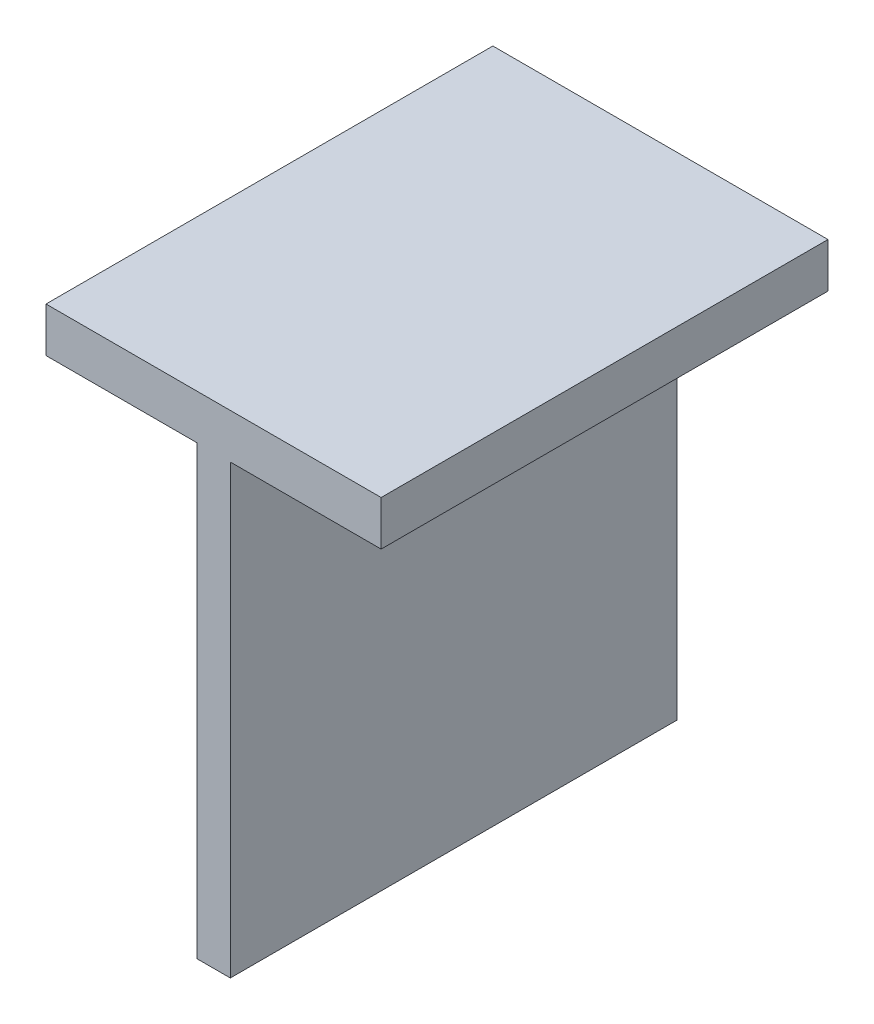
ISO-10303-21;
HEADER;
FILE_DESCRIPTION(('STEP AP214'),'2;1');
FILE_NAME('part.step','',(''),(''),'','','');
FILE_SCHEMA(('AUTOMOTIVE_DESIGN { 1 0 10303 214 1 1 1 1 }'));
ENDSEC;
DATA;
#1=APPLICATION_CONTEXT('core data for automotive mechanical design processes');
#2=APPLICATION_PROTOCOL_DEFINITION('international standard','automotive_design',2000,#1);
#3=PRODUCT_CONTEXT('',#1,'mechanical');
#4=PRODUCT('Part','Part','',(#3));
#5=PRODUCT_RELATED_PRODUCT_CATEGORY('part','',(#4));
#6=PRODUCT_DEFINITION_FORMATION('','',#4);
#7=PRODUCT_DEFINITION_CONTEXT('part definition',#1,'design');
#8=PRODUCT_DEFINITION('design','',#6,#7);
#9=PRODUCT_DEFINITION_SHAPE('','',#8);
#10=(LENGTH_UNIT() NAMED_UNIT(*) SI_UNIT(.MILLI.,.METRE.));
#11=(NAMED_UNIT(*) PLANE_ANGLE_UNIT() SI_UNIT($,.RADIAN.));
#12=(NAMED_UNIT(*) SI_UNIT($,.STERADIAN.) SOLID_ANGLE_UNIT());
#13=UNCERTAINTY_MEASURE_WITH_UNIT(LENGTH_MEASURE(1.E-05),#10,'distance_accuracy_value','');
#14=(GEOMETRIC_REPRESENTATION_CONTEXT(3) GLOBAL_UNCERTAINTY_ASSIGNED_CONTEXT((#13)) GLOBAL_UNIT_ASSIGNED_CONTEXT((#10,
#11,#12)) REPRESENTATION_CONTEXT('',''));
#15=CARTESIAN_POINT('',(0.,0.,0.));
#16=DIRECTION('',(0.,0.,1.));
#17=DIRECTION('',(1.,0.,0.));
#18=AXIS2_PLACEMENT_3D('',#15,#16,#17);
#19=CARTESIAN_POINT('',(-75.,0.,2000.));
#20=DIRECTION('',(0.,1.,0.));
#21=DIRECTION('',(0.,0.,1.));
#22=AXIS2_PLACEMENT_3D('',#19,#20,#21);
#23=PLANE('',#22);
#24=DIRECTION('',(1.,0.,0.));
#25=VECTOR('',#24,1.);
#26=CARTESIAN_POINT('',(-75.,0.,0.));
#27=LINE('',#26,#25);
#28=CARTESIAN_POINT('',(-75.,0.,0.));
#29=VERTEX_POINT('',#28);
#30=CARTESIAN_POINT('',(75.,0.,0.));
#31=VERTEX_POINT('',#30);
#32=EDGE_CURVE('E133',#29,#31,#27,.T.);
#33=ORIENTED_EDGE('',*,*,#32,.T.);
#34=DIRECTION('',(0.,0.,-1.));
#35=VECTOR('',#34,1.);
#36=CARTESIAN_POINT('',(75.,0.,2000.));
#37=LINE('',#36,#35);
#38=CARTESIAN_POINT('',(75.,0.,2000.));
#39=VERTEX_POINT('',#38);
#40=EDGE_CURVE('E11',#39,#31,#37,.T.);
#41=ORIENTED_EDGE('',*,*,#40,.F.);
#42=DIRECTION('',(1.,0.,0.));
#43=VECTOR('',#42,1.);
#44=CARTESIAN_POINT('',(-75.,0.,2000.));
#45=LINE('',#44,#43);
#46=CARTESIAN_POINT('',(-75.,0.,2000.));
#47=VERTEX_POINT('',#46);
#48=EDGE_CURVE('E147',#47,#39,#45,.T.);
#49=ORIENTED_EDGE('',*,*,#48,.F.);
#50=DIRECTION('',(0.,0.,-1.));
#51=VECTOR('',#50,1.);
#52=CARTESIAN_POINT('',(-75.,0.,2000.));
#53=LINE('',#52,#51);
#54=EDGE_CURVE('E129',#47,#29,#53,.T.);
#55=ORIENTED_EDGE('',*,*,#54,.T.);
#56=EDGE_LOOP('',(#33,#41,#49,#55));
#57=FACE_BOUND('',#56,.T.);
#58=ADVANCED_FACE('F37',(#57),#23,.F.);
#59=CARTESIAN_POINT('',(75.,0.,2000.));
#60=DIRECTION('',(-1.,0.,0.));
#61=DIRECTION('',(0.,-1.,0.));
#62=AXIS2_PLACEMENT_3D('',#59,#60,#61);
#63=PLANE('',#62);
#64=DIRECTION('',(0.,1.,0.));
#65=VECTOR('',#64,1.);
#66=CARTESIAN_POINT('',(75.,0.,0.));
#67=LINE('',#66,#65);
#68=CARTESIAN_POINT('',(75.0000000000002,2000.,0.));
#69=VERTEX_POINT('',#68);
#70=EDGE_CURVE('E136',#31,#69,#67,.T.);
#71=ORIENTED_EDGE('',*,*,#70,.T.);
#72=DIRECTION('',(0.,0.,-1.));
#73=VECTOR('',#72,1.);
#74=CARTESIAN_POINT('',(75.0000000000002,2000.,2000.));
#75=LINE('',#74,#73);
#76=CARTESIAN_POINT('',(75.0000000000002,2000.,2000.));
#77=VERTEX_POINT('',#76);
#78=EDGE_CURVE('E45',#77,#69,#75,.T.);
#79=ORIENTED_EDGE('',*,*,#78,.F.);
#80=DIRECTION('',(0.,1.,0.));
#81=VECTOR('',#80,1.);
#82=CARTESIAN_POINT('',(75.,0.,2000.));
#83=LINE('',#82,#81);
#84=EDGE_CURVE('E96',#39,#77,#83,.T.);
#85=ORIENTED_EDGE('',*,*,#84,.F.);
#86=ORIENTED_EDGE('',*,*,#40,.T.);
#87=EDGE_LOOP('',(#71,#79,#85,#86));
#88=FACE_BOUND('',#87,.T.);
#89=ADVANCED_FACE('F182',(#88),#63,.F.);
#90=CARTESIAN_POINT('',(75.0000000000002,2000.,2000.));
#91=DIRECTION('',(0.,1.,0.));
#92=DIRECTION('',(0.,0.,1.));
#93=AXIS2_PLACEMENT_3D('',#90,#91,#92);
#94=PLANE('',#93);
#95=DIRECTION('',(1.,0.,0.));
#96=VECTOR('',#95,1.);
#97=CARTESIAN_POINT('',(75.0000000000002,2000.,0.));
#98=LINE('',#97,#96);
#99=CARTESIAN_POINT('',(750.,2000.,0.));
#100=VERTEX_POINT('',#99);
#101=EDGE_CURVE('E138',#69,#100,#98,.T.);
#102=ORIENTED_EDGE('',*,*,#101,.T.);
#103=DIRECTION('',(0.,0.,-1.));
#104=VECTOR('',#103,1.);
#105=CARTESIAN_POINT('',(750.,2000.,2000.));
#106=LINE('',#105,#104);
#107=CARTESIAN_POINT('',(750.,2000.,2000.));
#108=VERTEX_POINT('',#107);
#109=EDGE_CURVE('E154',#108,#100,#106,.T.);
#110=ORIENTED_EDGE('',*,*,#109,.F.);
#111=DIRECTION('',(1.,0.,0.));
#112=VECTOR('',#111,1.);
#113=CARTESIAN_POINT('',(75.0000000000002,2000.,2000.));
#114=LINE('',#113,#112);
#115=EDGE_CURVE('E162',#77,#108,#114,.T.);
#116=ORIENTED_EDGE('',*,*,#115,.F.);
#117=ORIENTED_EDGE('',*,*,#78,.T.);
#118=EDGE_LOOP('',(#102,#110,#116,#117));
#119=FACE_BOUND('',#118,.T.);
#120=ADVANCED_FACE('F160',(#119),#94,.F.);
#121=CARTESIAN_POINT('',(750.,2000.,2000.));
#122=DIRECTION('',(-1.,0.,0.));
#123=DIRECTION('',(0.,0.,1.));
#124=AXIS2_PLACEMENT_3D('',#121,#122,#123);
#125=PLANE('',#124);
#126=DIRECTION('',(0.,1.,0.));
#127=VECTOR('',#126,1.);
#128=CARTESIAN_POINT('',(750.,2000.,0.));
#129=LINE('',#128,#127);
#130=CARTESIAN_POINT('',(750.,2200.,0.));
#131=VERTEX_POINT('',#130);
#132=EDGE_CURVE('E140',#100,#131,#129,.T.);
#133=ORIENTED_EDGE('',*,*,#132,.T.);
#134=DIRECTION('',(0.,0.,-1.));
#135=VECTOR('',#134,1.);
#136=CARTESIAN_POINT('',(750.,2200.,2000.));
#137=LINE('',#136,#135);
#138=CARTESIAN_POINT('',(750.,2200.,2000.));
#139=VERTEX_POINT('',#138);
#140=EDGE_CURVE('E151',#139,#131,#137,.T.);
#141=ORIENTED_EDGE('',*,*,#140,.F.);
#142=DIRECTION('',(0.,1.,0.));
#143=VECTOR('',#142,1.);
#144=CARTESIAN_POINT('',(750.,2000.,2000.));
#145=LINE('',#144,#143);
#146=EDGE_CURVE('E174',#108,#139,#145,.T.);
#147=ORIENTED_EDGE('',*,*,#146,.F.);
#148=ORIENTED_EDGE('',*,*,#109,.T.);
#149=EDGE_LOOP('',(#133,#141,#147,#148));
#150=FACE_BOUND('',#149,.T.);
#151=ADVANCED_FACE('F170',(#150),#125,.F.);
#152=CARTESIAN_POINT('',(750.,2200.,2000.));
#153=DIRECTION('',(0.,-1.,0.));
#154=DIRECTION('',(0.,0.,-1.));
#155=AXIS2_PLACEMENT_3D('',#152,#153,#154);
#156=PLANE('',#155);
#157=DIRECTION('',(-1.,0.,0.));
#158=VECTOR('',#157,1.);
#159=CARTESIAN_POINT('',(750.,2200.,0.));
#160=LINE('',#159,#158);
#161=CARTESIAN_POINT('',(-750.,2200.,0.));
#162=VERTEX_POINT('',#161);
#163=EDGE_CURVE('E142',#131,#162,#160,.T.);
#164=ORIENTED_EDGE('',*,*,#163,.T.);
#165=DIRECTION('',(0.,0.,-1.));
#166=VECTOR('',#165,1.);
#167=CARTESIAN_POINT('',(-750.,2200.,2000.));
#168=LINE('',#167,#166);
#169=CARTESIAN_POINT('',(-750.,2200.,2000.));
#170=VERTEX_POINT('',#169);
#171=EDGE_CURVE('E124',#170,#162,#168,.T.);
#172=ORIENTED_EDGE('',*,*,#171,.F.);
#173=DIRECTION('',(-1.,0.,0.));
#174=VECTOR('',#173,1.);
#175=CARTESIAN_POINT('',(750.,2200.,2000.));
#176=LINE('',#175,#174);
#177=EDGE_CURVE('E115',#139,#170,#176,.T.);
#178=ORIENTED_EDGE('',*,*,#177,.F.);
#179=ORIENTED_EDGE('',*,*,#140,.T.);
#180=EDGE_LOOP('',(#164,#172,#178,#179));
#181=FACE_BOUND('',#180,.T.);
#182=ADVANCED_FACE('F173',(#181),#156,.F.);
#183=CARTESIAN_POINT('',(-750.,2200.,2000.));
#184=DIRECTION('',(1.,0.,0.));
#185=DIRECTION('',(0.,0.,-1.));
#186=AXIS2_PLACEMENT_3D('',#183,#184,#185);
#187=PLANE('',#186);
#188=DIRECTION('',(0.,-1.,0.));
#189=VECTOR('',#188,1.);
#190=CARTESIAN_POINT('',(-750.,2200.,0.));
#191=LINE('',#190,#189);
#192=CARTESIAN_POINT('',(-750.,2000.,0.));
#193=VERTEX_POINT('',#192);
#194=EDGE_CURVE('E123',#162,#193,#191,.T.);
#195=ORIENTED_EDGE('',*,*,#194,.T.);
#196=DIRECTION('',(0.,0.,-1.));
#197=VECTOR('',#196,1.);
#198=CARTESIAN_POINT('',(-750.,2000.,2000.));
#199=LINE('',#198,#197);
#200=CARTESIAN_POINT('',(-750.,2000.,2000.));
#201=VERTEX_POINT('',#200);
#202=EDGE_CURVE('E120',#201,#193,#199,.T.);
#203=ORIENTED_EDGE('',*,*,#202,.F.);
#204=DIRECTION('',(0.,-1.,0.));
#205=VECTOR('',#204,1.);
#206=CARTESIAN_POINT('',(-750.,2200.,2000.));
#207=LINE('',#206,#205);
#208=EDGE_CURVE('E109',#170,#201,#207,.T.);
#209=ORIENTED_EDGE('',*,*,#208,.F.);
#210=ORIENTED_EDGE('',*,*,#171,.T.);
#211=EDGE_LOOP('',(#195,#203,#209,#210));
#212=FACE_BOUND('',#211,.T.);
#213=ADVANCED_FACE('F121',(#212),#187,.F.);
#214=CARTESIAN_POINT('',(-750.,2000.,2000.));
#215=DIRECTION('',(0.,1.,0.));
#216=DIRECTION('',(0.,0.,1.));
#217=AXIS2_PLACEMENT_3D('',#214,#215,#216);
#218=PLANE('',#217);
#219=DIRECTION('',(1.,0.,0.));
#220=VECTOR('',#219,1.);
#221=CARTESIAN_POINT('',(-750.,2000.,0.));
#222=LINE('',#221,#220);
#223=CARTESIAN_POINT('',(-75.0000000000002,2000.,0.));
#224=VERTEX_POINT('',#223);
#225=EDGE_CURVE('E82',#193,#224,#222,.T.);
#226=ORIENTED_EDGE('',*,*,#225,.T.);
#227=DIRECTION('',(0.,0.,-1.));
#228=VECTOR('',#227,1.);
#229=CARTESIAN_POINT('',(-75.0000000000002,2000.,2000.));
#230=LINE('',#229,#228);
#231=CARTESIAN_POINT('',(-75.0000000000002,2000.,2000.));
#232=VERTEX_POINT('',#231);
#233=EDGE_CURVE('E125',#232,#224,#230,.T.);
#234=ORIENTED_EDGE('',*,*,#233,.F.);
#235=DIRECTION('',(1.,0.,0.));
#236=VECTOR('',#235,1.);
#237=CARTESIAN_POINT('',(-750.,2000.,2000.));
#238=LINE('',#237,#236);
#239=EDGE_CURVE('E113',#201,#232,#238,.T.);
#240=ORIENTED_EDGE('',*,*,#239,.F.);
#241=ORIENTED_EDGE('',*,*,#202,.T.);
#242=EDGE_LOOP('',(#226,#234,#240,#241));
#243=FACE_BOUND('',#242,.T.);
#244=ADVANCED_FACE('F127',(#243),#218,.F.);
#245=CARTESIAN_POINT('',(-75.0000000000002,2000.,2000.));
#246=DIRECTION('',(1.,0.,0.));
#247=DIRECTION('',(0.,1.,0.));
#248=AXIS2_PLACEMENT_3D('',#245,#246,#247);
#249=PLANE('',#248);
#250=DIRECTION('',(0.,-1.,0.));
#251=VECTOR('',#250,1.);
#252=CARTESIAN_POINT('',(-75.0000000000002,2000.,0.));
#253=LINE('',#252,#251);
#254=EDGE_CURVE('E88',#224,#29,#253,.T.);
#255=ORIENTED_EDGE('',*,*,#254,.T.);
#256=ORIENTED_EDGE('',*,*,#54,.F.);
#257=DIRECTION('',(0.,-1.,0.));
#258=VECTOR('',#257,1.);
#259=CARTESIAN_POINT('',(-75.0000000000002,2000.,2000.));
#260=LINE('',#259,#258);
#261=EDGE_CURVE('E53',#232,#47,#260,.T.);
#262=ORIENTED_EDGE('',*,*,#261,.F.);
#263=ORIENTED_EDGE('',*,*,#233,.T.);
#264=EDGE_LOOP('',(#255,#256,#262,#263));
#265=FACE_BOUND('',#264,.T.);
#266=ADVANCED_FACE('F198',(#265),#249,.F.);
#267=CARTESIAN_POINT('',(0.,0.,2000.));
#268=DIRECTION('',(0.,0.,1.));
#269=DIRECTION('',(1.,0.,0.));
#270=AXIS2_PLACEMENT_3D('',#267,#268,#269);
#271=PLANE('',#270);
#272=ORIENTED_EDGE('',*,*,#48,.T.);
#273=ORIENTED_EDGE('',*,*,#84,.T.);
#274=ORIENTED_EDGE('',*,*,#115,.T.);
#275=ORIENTED_EDGE('',*,*,#146,.T.);
#276=ORIENTED_EDGE('',*,*,#177,.T.);
#277=ORIENTED_EDGE('',*,*,#208,.T.);
#278=ORIENTED_EDGE('',*,*,#239,.T.);
#279=ORIENTED_EDGE('',*,*,#261,.T.);
#280=EDGE_LOOP('',(#272,#273,#274,#275,#276,#277,#278,#279));
#281=FACE_BOUND('',#280,.T.);
#282=ADVANCED_FACE('F111',(#281),#271,.T.);
#283=CARTESIAN_POINT('',(0.,0.,0.));
#284=DIRECTION('',(0.,0.,1.));
#285=DIRECTION('',(1.,0.,0.));
#286=AXIS2_PLACEMENT_3D('',#283,#284,#285);
#287=PLANE('',#286);
#288=ORIENTED_EDGE('',*,*,#32,.F.);
#289=ORIENTED_EDGE('',*,*,#254,.F.);
#290=ORIENTED_EDGE('',*,*,#225,.F.);
#291=ORIENTED_EDGE('',*,*,#194,.F.);
#292=ORIENTED_EDGE('',*,*,#163,.F.);
#293=ORIENTED_EDGE('',*,*,#132,.F.);
#294=ORIENTED_EDGE('',*,*,#101,.F.);
#295=ORIENTED_EDGE('',*,*,#70,.F.);
#296=EDGE_LOOP('',(#288,#289,#290,#291,#292,#293,#294,#295));
#297=FACE_BOUND('',#296,.T.);
#298=ADVANCED_FACE('F166',(#297),#287,.F.);
#299=CLOSED_SHELL('',(#58,#89,#120,#151,#182,#213,#244,#266,#282,#298));
#300=MANIFOLD_SOLID_BREP('B2',#299);
#301=ADVANCED_BREP_SHAPE_REPRESENTATION('',(#18,#300),#14);
#302=SHAPE_DEFINITION_REPRESENTATION(#9,#301);
ENDSEC;
END-ISO-10303-21;
